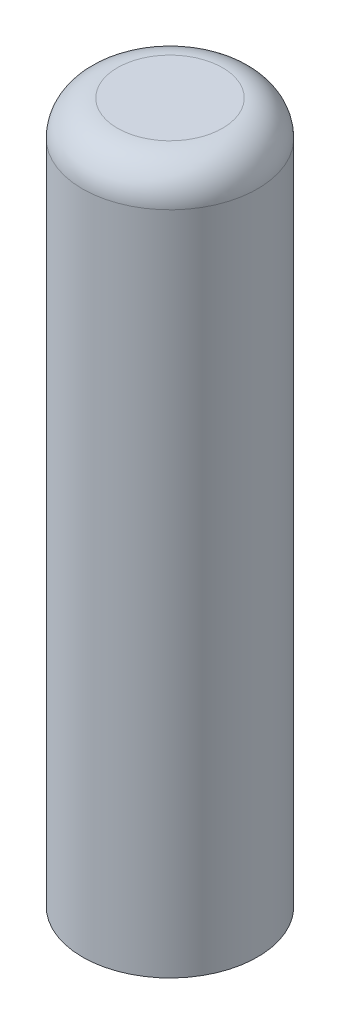
ISO-10303-21;
HEADER;
FILE_DESCRIPTION(('STEP AP214'),'2;1');
FILE_NAME('part.step','',(''),(''),'','','');
FILE_SCHEMA(('AUTOMOTIVE_DESIGN { 1 0 10303 214 1 1 1 1 }'));
ENDSEC;
DATA;
#1=APPLICATION_CONTEXT('core data for automotive mechanical design processes');
#2=APPLICATION_PROTOCOL_DEFINITION('international standard','automotive_design',2000,#1);
#3=PRODUCT_CONTEXT('',#1,'mechanical');
#4=PRODUCT('Part','Part','',(#3));
#5=PRODUCT_RELATED_PRODUCT_CATEGORY('part','',(#4));
#6=PRODUCT_DEFINITION_FORMATION('','',#4);
#7=PRODUCT_DEFINITION_CONTEXT('part definition',#1,'design');
#8=PRODUCT_DEFINITION('design','',#6,#7);
#9=PRODUCT_DEFINITION_SHAPE('','',#8);
#10=(LENGTH_UNIT() NAMED_UNIT(*) SI_UNIT(.MILLI.,.METRE.));
#11=(NAMED_UNIT(*) PLANE_ANGLE_UNIT() SI_UNIT($,.RADIAN.));
#12=(NAMED_UNIT(*) SI_UNIT($,.STERADIAN.) SOLID_ANGLE_UNIT());
#13=UNCERTAINTY_MEASURE_WITH_UNIT(LENGTH_MEASURE(1.E-05),#10,'distance_accuracy_value','');
#14=(GEOMETRIC_REPRESENTATION_CONTEXT(3) GLOBAL_UNCERTAINTY_ASSIGNED_CONTEXT((#13)) GLOBAL_UNIT_ASSIGNED_CONTEXT((#10,
#11,#12)) REPRESENTATION_CONTEXT('',''));
#15=CARTESIAN_POINT('',(0.,0.,0.));
#16=DIRECTION('',(0.,0.,1.));
#17=DIRECTION('',(1.,0.,0.));
#18=AXIS2_PLACEMENT_3D('',#15,#16,#17);
#19=CARTESIAN_POINT('',(0.975,10.,-0.6));
#20=DIRECTION('',(-1.,0.,0.));
#21=DIRECTION('',(0.,0.,1.));
#22=AXIS2_PLACEMENT_3D('',#19,#20,#21);
#23=PLANE('',#22);
#24=DIRECTION('',(0.,-1.,0.));
#25=VECTOR('',#24,1.);
#26=CARTESIAN_POINT('',(0.975,10.,0.6));
#27=LINE('',#26,#25);
#28=CARTESIAN_POINT('',(0.975,-6.,0.6));
#29=VERTEX_POINT('',#28);
#30=CARTESIAN_POINT('',(0.975,-10.,0.6));
#31=VERTEX_POINT('',#30);
#32=EDGE_CURVE('E63',#29,#31,#27,.T.);
#33=ORIENTED_EDGE('',*,*,#32,.F.);
#34=DIRECTION('',(0.,0.,-1.));
#35=VECTOR('',#34,1.);
#36=CARTESIAN_POINT('',(0.975,-6.,0.6));
#37=LINE('',#36,#35);
#38=CARTESIAN_POINT('',(0.975,-6.,-0.6));
#39=VERTEX_POINT('',#38);
#40=EDGE_CURVE('E56',#29,#39,#37,.T.);
#41=ORIENTED_EDGE('',*,*,#40,.T.);
#42=DIRECTION('',(0.,-1.,0.));
#43=VECTOR('',#42,1.);
#44=CARTESIAN_POINT('',(0.975,10.,-0.6));
#45=LINE('',#44,#43);
#46=CARTESIAN_POINT('',(0.975,-10.,-0.6));
#47=VERTEX_POINT('',#46);
#48=EDGE_CURVE('E90',#39,#47,#45,.T.);
#49=ORIENTED_EDGE('',*,*,#48,.T.);
#50=DIRECTION('',(0.,0.,-1.));
#51=VECTOR('',#50,1.);
#52=CARTESIAN_POINT('',(0.975,-10.,-0.6));
#53=LINE('',#52,#51);
#54=EDGE_CURVE('E141',#31,#47,#53,.T.);
#55=ORIENTED_EDGE('',*,*,#54,.F.);
#56=EDGE_LOOP('',(#33,#41,#49,#55));
#57=FACE_BOUND('',#56,.T.);
#58=ADVANCED_FACE('F41',(#57),#23,.T.);
#59=CARTESIAN_POINT('',(-0.975,10.,-0.6));
#60=DIRECTION('',(0.,0.,1.));
#61=DIRECTION('',(1.,0.,0.));
#62=AXIS2_PLACEMENT_3D('',#59,#60,#61);
#63=PLANE('',#62);
#64=ORIENTED_EDGE('',*,*,#48,.F.);
#65=DIRECTION('',(-1.,0.,0.));
#66=VECTOR('',#65,1.);
#67=CARTESIAN_POINT('',(0.975,-6.,-0.6));
#68=LINE('',#67,#66);
#69=CARTESIAN_POINT('',(-0.975,-6.,-0.6));
#70=VERTEX_POINT('',#69);
#71=EDGE_CURVE('E81',#39,#70,#68,.T.);
#72=ORIENTED_EDGE('',*,*,#71,.T.);
#73=DIRECTION('',(0.,-1.,0.));
#74=VECTOR('',#73,1.);
#75=CARTESIAN_POINT('',(-0.975,10.,-0.6));
#76=LINE('',#75,#74);
#77=CARTESIAN_POINT('',(-0.975,-10.,-0.6));
#78=VERTEX_POINT('',#77);
#79=EDGE_CURVE('E99',#70,#78,#76,.T.);
#80=ORIENTED_EDGE('',*,*,#79,.T.);
#81=DIRECTION('',(-1.,0.,0.));
#82=VECTOR('',#81,1.);
#83=CARTESIAN_POINT('',(-0.975,-10.,-0.6));
#84=LINE('',#83,#82);
#85=EDGE_CURVE('E96',#47,#78,#84,.T.);
#86=ORIENTED_EDGE('',*,*,#85,.F.);
#87=EDGE_LOOP('',(#64,#72,#80,#86));
#88=FACE_BOUND('',#87,.T.);
#89=ADVANCED_FACE('F94',(#88),#63,.T.);
#90=CARTESIAN_POINT('',(-0.975,10.,-0.6));
#91=DIRECTION('',(1.,0.,0.));
#92=DIRECTION('',(0.,0.,-1.));
#93=AXIS2_PLACEMENT_3D('',#90,#91,#92);
#94=PLANE('',#93);
#95=ORIENTED_EDGE('',*,*,#79,.F.);
#96=DIRECTION('',(0.,0.,1.));
#97=VECTOR('',#96,1.);
#98=CARTESIAN_POINT('',(-0.975,-6.,-0.6));
#99=LINE('',#98,#97);
#100=CARTESIAN_POINT('',(-0.975,-6.,0.6));
#101=VERTEX_POINT('',#100);
#102=EDGE_CURVE('E84',#70,#101,#99,.T.);
#103=ORIENTED_EDGE('',*,*,#102,.T.);
#104=DIRECTION('',(0.,-1.,0.));
#105=VECTOR('',#104,1.);
#106=CARTESIAN_POINT('',(-0.975,10.,0.6));
#107=LINE('',#106,#105);
#108=CARTESIAN_POINT('',(-0.975,-10.,0.6));
#109=VERTEX_POINT('',#108);
#110=EDGE_CURVE('E103',#101,#109,#107,.T.);
#111=ORIENTED_EDGE('',*,*,#110,.T.);
#112=DIRECTION('',(0.,0.,1.));
#113=VECTOR('',#112,1.);
#114=CARTESIAN_POINT('',(-0.975,-10.,-0.6));
#115=LINE('',#114,#113);
#116=EDGE_CURVE('E145',#78,#109,#115,.T.);
#117=ORIENTED_EDGE('',*,*,#116,.F.);
#118=EDGE_LOOP('',(#95,#103,#111,#117));
#119=FACE_BOUND('',#118,.T.);
#120=ADVANCED_FACE('F127',(#119),#94,.T.);
#121=CARTESIAN_POINT('',(-0.975,10.,0.6));
#122=DIRECTION('',(0.,0.,-1.));
#123=DIRECTION('',(-1.,0.,0.));
#124=AXIS2_PLACEMENT_3D('',#121,#122,#123);
#125=PLANE('',#124);
#126=ORIENTED_EDGE('',*,*,#110,.F.);
#127=DIRECTION('',(1.,0.,0.));
#128=VECTOR('',#127,1.);
#129=CARTESIAN_POINT('',(-0.975,-6.,0.6));
#130=LINE('',#129,#128);
#131=EDGE_CURVE('E92',#101,#29,#130,.T.);
#132=ORIENTED_EDGE('',*,*,#131,.T.);
#133=ORIENTED_EDGE('',*,*,#32,.T.);
#134=DIRECTION('',(1.,0.,0.));
#135=VECTOR('',#134,1.);
#136=CARTESIAN_POINT('',(-0.975,-10.,0.6));
#137=LINE('',#136,#135);
#138=EDGE_CURVE('E143',#109,#31,#137,.T.);
#139=ORIENTED_EDGE('',*,*,#138,.F.);
#140=EDGE_LOOP('',(#126,#132,#133,#139));
#141=FACE_BOUND('',#140,.T.);
#142=ADVANCED_FACE('F133',(#141),#125,.T.);
#143=CARTESIAN_POINT('',(0.,10.,0.));
#144=DIRECTION('',(0.,1.,0.));
#145=DIRECTION('',(0.,0.,1.));
#146=AXIS2_PLACEMENT_3D('',#143,#144,#145);
#147=PLANE('',#146);
#148=CARTESIAN_POINT('',(0.,10.,0.));
#149=DIRECTION('',(0.,1.,0.));
#150=DIRECTION('',(0.,0.,1.));
#151=AXIS2_PLACEMENT_3D('',#148,#149,#150);
#152=CIRCLE('',#151,1.5);
#153=CARTESIAN_POINT('',(0.,10.,1.5));
#154=VERTEX_POINT('',#153);
#155=EDGE_CURVE('E49',#154,#154,#152,.T.);
#156=ORIENTED_EDGE('',*,*,#155,.T.);
#157=EDGE_LOOP('',(#156));
#158=FACE_BOUND('',#157,.T.);
#159=ADVANCED_FACE('F109',(#158),#147,.T.);
#160=CARTESIAN_POINT('',(0.,-10.,0.));
#161=DIRECTION('',(0.,1.,0.));
#162=DIRECTION('',(0.,0.,1.));
#163=AXIS2_PLACEMENT_3D('',#160,#161,#162);
#164=PLANE('',#163);
#165=CARTESIAN_POINT('',(0.,-10.,0.));
#166=DIRECTION('',(0.,1.,0.));
#167=DIRECTION('',(0.,0.,1.));
#168=AXIS2_PLACEMENT_3D('',#165,#166,#167);
#169=CIRCLE('',#168,2.5);
#170=CARTESIAN_POINT('',(0.,-10.,2.5));
#171=VERTEX_POINT('',#170);
#172=EDGE_CURVE('E98',#171,#171,#169,.T.);
#173=ORIENTED_EDGE('',*,*,#172,.F.);
#174=EDGE_LOOP('',(#173));
#175=FACE_BOUND('',#174,.T.);
#176=ORIENTED_EDGE('',*,*,#54,.T.);
#177=ORIENTED_EDGE('',*,*,#85,.T.);
#178=ORIENTED_EDGE('',*,*,#116,.T.);
#179=ORIENTED_EDGE('',*,*,#138,.T.);
#180=EDGE_LOOP('',(#176,#177,#178,#179));
#181=FACE_BOUND('',#180,.T.);
#182=ADVANCED_FACE('F120',(#175,#181),#164,.F.);
#183=CARTESIAN_POINT('',(0.,10.,0.));
#184=DIRECTION('',(0.,-1.,0.));
#185=DIRECTION('',(0.,0.,-1.));
#186=AXIS2_PLACEMENT_3D('',#183,#184,#185);
#187=CYLINDRICAL_SURFACE('',#186,2.5);
#188=CARTESIAN_POINT('',(0.,9.,0.));
#189=DIRECTION('',(0.,1.,0.));
#190=DIRECTION('',(0.,0.,1.));
#191=AXIS2_PLACEMENT_3D('',#188,#189,#190);
#192=CIRCLE('',#191,2.5);
#193=CARTESIAN_POINT('',(0.,9.,2.5));
#194=VERTEX_POINT('',#193);
#195=EDGE_CURVE('E11',#194,#194,#192,.F.);
#196=ORIENTED_EDGE('',*,*,#195,.T.);
#197=EDGE_LOOP('',(#196));
#198=FACE_BOUND('',#197,.T.);
#199=ORIENTED_EDGE('',*,*,#172,.T.);
#200=EDGE_LOOP('',(#199));
#201=FACE_BOUND('',#200,.T.);
#202=ADVANCED_FACE('F112',(#198,#201),#187,.T.);
#203=CARTESIAN_POINT('',(0.,9.,0.));
#204=DIRECTION('',(0.,1.,0.));
#205=DIRECTION('',(0.,0.,1.));
#206=AXIS2_PLACEMENT_3D('',#203,#204,#205);
#207=TOROIDAL_SURFACE('',#206,1.5,1.);
#208=ORIENTED_EDGE('',*,*,#195,.F.);
#209=EDGE_LOOP('',(#208));
#210=FACE_BOUND('',#209,.T.);
#211=ORIENTED_EDGE('',*,*,#155,.F.);
#212=EDGE_LOOP('',(#211));
#213=FACE_BOUND('',#212,.T.);
#214=ADVANCED_FACE('F43',(#210,#213),#207,.T.);
#215=CARTESIAN_POINT('',(0.,-6.,0.));
#216=DIRECTION('',(0.,1.,0.));
#217=DIRECTION('',(0.,0.,1.));
#218=AXIS2_PLACEMENT_3D('',#215,#216,#217);
#219=PLANE('',#218);
#220=ORIENTED_EDGE('',*,*,#131,.F.);
#221=ORIENTED_EDGE('',*,*,#102,.F.);
#222=ORIENTED_EDGE('',*,*,#71,.F.);
#223=ORIENTED_EDGE('',*,*,#40,.F.);
#224=EDGE_LOOP('',(#220,#221,#222,#223));
#225=FACE_BOUND('',#224,.T.);
#226=ADVANCED_FACE('F82',(#225),#219,.F.);
#227=CLOSED_SHELL('',(#58,#89,#120,#142,#159,#182,#202,#214,#226));
#228=MANIFOLD_SOLID_BREP('B2',#227);
#229=ADVANCED_BREP_SHAPE_REPRESENTATION('',(#18,#228),#14);
#230=SHAPE_DEFINITION_REPRESENTATION(#9,#229);
ENDSEC;
END-ISO-10303-21;
